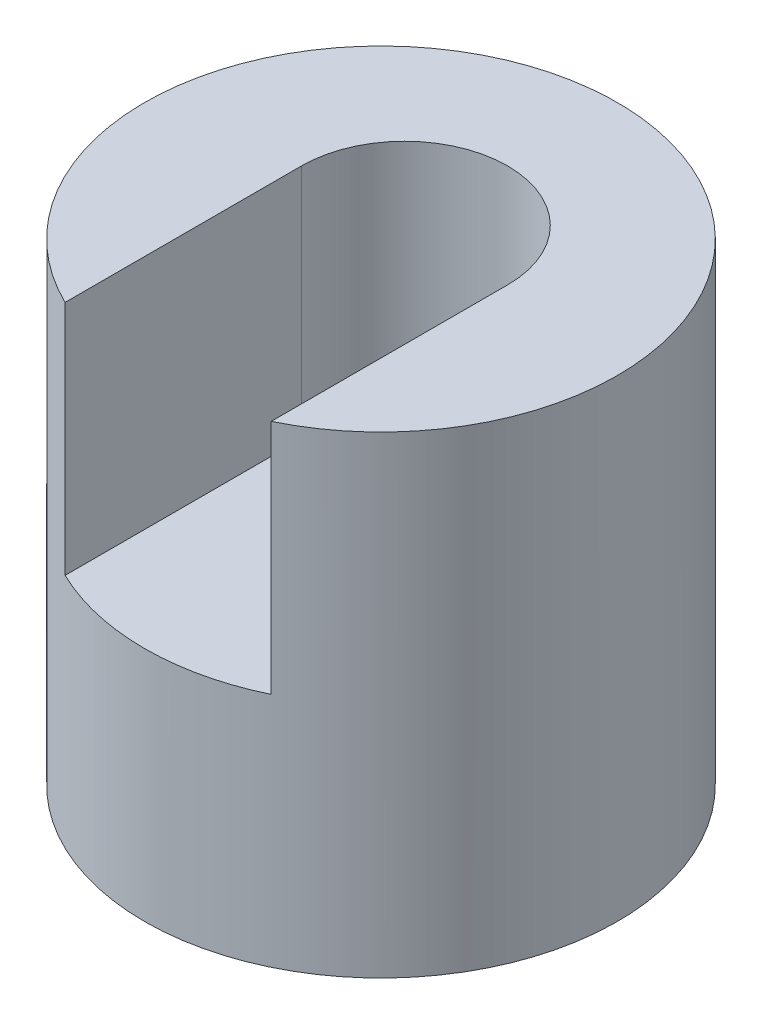
ISO-10303-21;
HEADER;
FILE_DESCRIPTION(('STEP AP214'),'2;1');
FILE_NAME('part.step','',(''),(''),'','','');
FILE_SCHEMA(('AUTOMOTIVE_DESIGN { 1 0 10303 214 1 1 1 1 }'));
ENDSEC;
DATA;
#1=APPLICATION_CONTEXT('core data for automotive mechanical design processes');
#2=APPLICATION_PROTOCOL_DEFINITION('international standard','automotive_design',2000,#1);
#3=PRODUCT_CONTEXT('',#1,'mechanical');
#4=PRODUCT('Part','Part','',(#3));
#5=PRODUCT_RELATED_PRODUCT_CATEGORY('part','',(#4));
#6=PRODUCT_DEFINITION_FORMATION('','',#4);
#7=PRODUCT_DEFINITION_CONTEXT('part definition',#1,'design');
#8=PRODUCT_DEFINITION('design','',#6,#7);
#9=PRODUCT_DEFINITION_SHAPE('','',#8);
#10=(LENGTH_UNIT() NAMED_UNIT(*) SI_UNIT(.MILLI.,.METRE.));
#11=(NAMED_UNIT(*) PLANE_ANGLE_UNIT() SI_UNIT($,.RADIAN.));
#12=(NAMED_UNIT(*) SI_UNIT($,.STERADIAN.) SOLID_ANGLE_UNIT());
#13=UNCERTAINTY_MEASURE_WITH_UNIT(LENGTH_MEASURE(1.E-05),#10,'distance_accuracy_value','');
#14=(GEOMETRIC_REPRESENTATION_CONTEXT(3) GLOBAL_UNCERTAINTY_ASSIGNED_CONTEXT((#13)) GLOBAL_UNIT_ASSIGNED_CONTEXT((#10,
#11,#12)) REPRESENTATION_CONTEXT('',''));
#15=CARTESIAN_POINT('',(0.,0.,0.));
#16=DIRECTION('',(0.,0.,1.));
#17=DIRECTION('',(1.,0.,0.));
#18=AXIS2_PLACEMENT_3D('',#15,#16,#17);
#19=CARTESIAN_POINT('',(0.,40.,40.));
#20=DIRECTION('',(0.,-1.,0.));
#21=DIRECTION('',(0.,0.,-1.));
#22=AXIS2_PLACEMENT_3D('',#19,#20,#21);
#23=PLANE('',#22);
#24=CARTESIAN_POINT('',(20.,40.,20.));
#25=DIRECTION('',(0.,1.,0.));
#26=DIRECTION('',(0.,0.,1.));
#27=AXIS2_PLACEMENT_3D('',#24,#25,#26);
#28=CIRCLE('',#27,20.);
#29=CARTESIAN_POINT('',(28.7177978870814,40.,38.));
#30=VERTEX_POINT('',#29);
#31=CARTESIAN_POINT('',(11.2822021129186,40.,38.));
#32=VERTEX_POINT('',#31);
#33=EDGE_CURVE('E165',#30,#32,#28,.T.);
#34=ORIENTED_EDGE('',*,*,#33,.T.);
#35=DIRECTION('',(0.,0.,1.));
#36=VECTOR('',#35,1.);
#37=CARTESIAN_POINT('',(11.2822021129186,40.,38.));
#38=LINE('',#37,#36);
#39=CARTESIAN_POINT('',(11.2822021129186,40.,18.));
#40=VERTEX_POINT('',#39);
#41=EDGE_CURVE('E146',#40,#32,#38,.T.);
#42=ORIENTED_EDGE('',*,*,#41,.F.);
#43=CARTESIAN_POINT('',(20.,40.,18.));
#44=DIRECTION('',(0.,1.,0.));
#45=DIRECTION('',(0.,0.,1.));
#46=AXIS2_PLACEMENT_3D('',#43,#44,#45);
#47=CIRCLE('',#46,8.71779788708136);
#48=CARTESIAN_POINT('',(28.7177978870814,40.,18.));
#49=VERTEX_POINT('',#48);
#50=EDGE_CURVE('E176',#49,#40,#47,.T.);
#51=ORIENTED_EDGE('',*,*,#50,.F.);
#52=DIRECTION('',(0.,0.,-1.));
#53=VECTOR('',#52,1.);
#54=CARTESIAN_POINT('',(28.7177978870814,40.,38.));
#55=LINE('',#54,#53);
#56=EDGE_CURVE('E178',#30,#49,#55,.T.);
#57=ORIENTED_EDGE('',*,*,#56,.F.);
#58=EDGE_LOOP('',(#34,#42,#51,#57));
#59=FACE_BOUND('',#58,.T.);
#60=ADVANCED_FACE('F105',(#59),#23,.F.);
#61=CARTESIAN_POINT('',(20.,0.,20.));
#62=DIRECTION('',(0.,1.,0.));
#63=DIRECTION('',(0.,0.,1.));
#64=AXIS2_PLACEMENT_3D('',#61,#62,#63);
#65=CYLINDRICAL_SURFACE('',#64,20.);
#66=CARTESIAN_POINT('',(20.,0.,20.));
#67=DIRECTION('',(0.,1.,0.));
#68=DIRECTION('',(0.,0.,1.));
#69=AXIS2_PLACEMENT_3D('',#66,#67,#68);
#70=CIRCLE('',#69,20.);
#71=CARTESIAN_POINT('',(20.,0.,40.));
#72=VERTEX_POINT('',#71);
#73=EDGE_CURVE('E167',#72,#72,#70,.T.);
#74=ORIENTED_EDGE('',*,*,#73,.T.);
#75=EDGE_LOOP('',(#74));
#76=FACE_BOUND('',#75,.T.);
#77=DIRECTION('',(0.,1.,0.));
#78=VECTOR('',#77,1.);
#79=CARTESIAN_POINT('',(28.7177978870814,0.,38.));
#80=LINE('',#79,#78);
#81=CARTESIAN_POINT('',(28.7177978870814,20.,38.));
#82=VERTEX_POINT('',#81);
#83=EDGE_CURVE('E12',#30,#82,#80,.F.);
#84=ORIENTED_EDGE('',*,*,#83,.T.);
#85=CARTESIAN_POINT('',(20.,20.,20.));
#86=DIRECTION('',(0.,1.,0.));
#87=DIRECTION('',(0.,0.,1.));
#88=AXIS2_PLACEMENT_3D('',#85,#86,#87);
#89=CIRCLE('',#88,20.);
#90=CARTESIAN_POINT('',(11.2822021129186,20.,38.));
#91=VERTEX_POINT('',#90);
#92=EDGE_CURVE('E113',#82,#91,#89,.F.);
#93=ORIENTED_EDGE('',*,*,#92,.T.);
#94=DIRECTION('',(0.,1.,0.));
#95=VECTOR('',#94,1.);
#96=CARTESIAN_POINT('',(11.2822021129186,0.,38.));
#97=LINE('',#96,#95);
#98=EDGE_CURVE('E161',#91,#32,#97,.T.);
#99=ORIENTED_EDGE('',*,*,#98,.T.);
#100=ORIENTED_EDGE('',*,*,#33,.F.);
#101=EDGE_LOOP('',(#84,#93,#99,#100));
#102=FACE_BOUND('',#101,.T.);
#103=ADVANCED_FACE('F163',(#76,#102),#65,.T.);
#104=CARTESIAN_POINT('',(0.,0.,40.));
#105=DIRECTION('',(0.,1.,0.));
#106=DIRECTION('',(0.,0.,1.));
#107=AXIS2_PLACEMENT_3D('',#104,#105,#106);
#108=PLANE('',#107);
#109=ORIENTED_EDGE('',*,*,#73,.F.);
#110=EDGE_LOOP('',(#109));
#111=FACE_BOUND('',#110,.T.);
#112=ADVANCED_FACE('F107',(#111),#108,.F.);
#113=CARTESIAN_POINT('',(40.,20.,40.));
#114=DIRECTION('',(0.,1.,0.));
#115=DIRECTION('',(0.,0.,1.));
#116=AXIS2_PLACEMENT_3D('',#113,#114,#115);
#117=PLANE('',#116);
#118=ORIENTED_EDGE('',*,*,#92,.F.);
#119=DIRECTION('',(0.,0.,-1.));
#120=VECTOR('',#119,1.);
#121=CARTESIAN_POINT('',(28.7177978870814,20.,38.));
#122=LINE('',#121,#120);
#123=CARTESIAN_POINT('',(28.7177978870814,20.,18.));
#124=VERTEX_POINT('',#123);
#125=EDGE_CURVE('E151',#82,#124,#122,.T.);
#126=ORIENTED_EDGE('',*,*,#125,.T.);
#127=CARTESIAN_POINT('',(20.,20.,18.));
#128=DIRECTION('',(0.,1.,0.));
#129=DIRECTION('',(0.,0.,1.));
#130=AXIS2_PLACEMENT_3D('',#127,#128,#129);
#131=CIRCLE('',#130,8.71779788708136);
#132=CARTESIAN_POINT('',(11.2822021129186,20.,18.));
#133=VERTEX_POINT('',#132);
#134=EDGE_CURVE('E156',#124,#133,#131,.T.);
#135=ORIENTED_EDGE('',*,*,#134,.T.);
#136=DIRECTION('',(0.,0.,1.));
#137=VECTOR('',#136,1.);
#138=CARTESIAN_POINT('',(11.2822021129186,20.,38.));
#139=LINE('',#138,#137);
#140=EDGE_CURVE('E120',#133,#91,#139,.T.);
#141=ORIENTED_EDGE('',*,*,#140,.T.);
#142=EDGE_LOOP('',(#118,#126,#135,#141));
#143=FACE_BOUND('',#142,.T.);
#144=ADVANCED_FACE('F159',(#143),#117,.T.);
#145=CARTESIAN_POINT('',(11.2822021129186,20.,38.));
#146=DIRECTION('',(-1.,0.,0.));
#147=DIRECTION('',(0.,0.,1.));
#148=AXIS2_PLACEMENT_3D('',#145,#146,#147);
#149=PLANE('',#148);
#150=ORIENTED_EDGE('',*,*,#41,.T.);
#151=ORIENTED_EDGE('',*,*,#98,.F.);
#152=ORIENTED_EDGE('',*,*,#140,.F.);
#153=DIRECTION('',(0.,1.,0.));
#154=VECTOR('',#153,1.);
#155=CARTESIAN_POINT('',(11.2822021129186,20.,18.));
#156=LINE('',#155,#154);
#157=EDGE_CURVE('E129',#133,#40,#156,.T.);
#158=ORIENTED_EDGE('',*,*,#157,.T.);
#159=EDGE_LOOP('',(#150,#151,#152,#158));
#160=FACE_BOUND('',#159,.T.);
#161=ADVANCED_FACE('F181',(#160),#149,.F.);
#162=CARTESIAN_POINT('',(20.,20.,18.));
#163=DIRECTION('',(0.,1.,0.));
#164=DIRECTION('',(0.,0.,1.));
#165=AXIS2_PLACEMENT_3D('',#162,#163,#164);
#166=CYLINDRICAL_SURFACE('',#165,8.71779788708136);
#167=ORIENTED_EDGE('',*,*,#50,.T.);
#168=ORIENTED_EDGE('',*,*,#157,.F.);
#169=ORIENTED_EDGE('',*,*,#134,.F.);
#170=DIRECTION('',(0.,1.,0.));
#171=VECTOR('',#170,1.);
#172=CARTESIAN_POINT('',(28.7177978870814,20.,18.));
#173=LINE('',#172,#171);
#174=EDGE_CURVE('E155',#124,#49,#173,.T.);
#175=ORIENTED_EDGE('',*,*,#174,.T.);
#176=EDGE_LOOP('',(#167,#168,#169,#175));
#177=FACE_BOUND('',#176,.T.);
#178=ADVANCED_FACE('F183',(#177),#166,.F.);
#179=CARTESIAN_POINT('',(28.7177978870814,20.,38.));
#180=DIRECTION('',(1.,0.,0.));
#181=DIRECTION('',(0.,0.,-1.));
#182=AXIS2_PLACEMENT_3D('',#179,#180,#181);
#183=PLANE('',#182);
#184=ORIENTED_EDGE('',*,*,#56,.T.);
#185=ORIENTED_EDGE('',*,*,#174,.F.);
#186=ORIENTED_EDGE('',*,*,#125,.F.);
#187=ORIENTED_EDGE('',*,*,#83,.F.);
#188=EDGE_LOOP('',(#184,#185,#186,#187));
#189=FACE_BOUND('',#188,.T.);
#190=ADVANCED_FACE('F153',(#189),#183,.F.);
#191=CLOSED_SHELL('',(#60,#103,#112,#144,#161,#178,#190));
#192=MANIFOLD_SOLID_BREP('B2',#191);
#193=ADVANCED_BREP_SHAPE_REPRESENTATION('',(#18,#192),#14);
#194=SHAPE_DEFINITION_REPRESENTATION(#9,#193);
ENDSEC;
END-ISO-10303-21;
